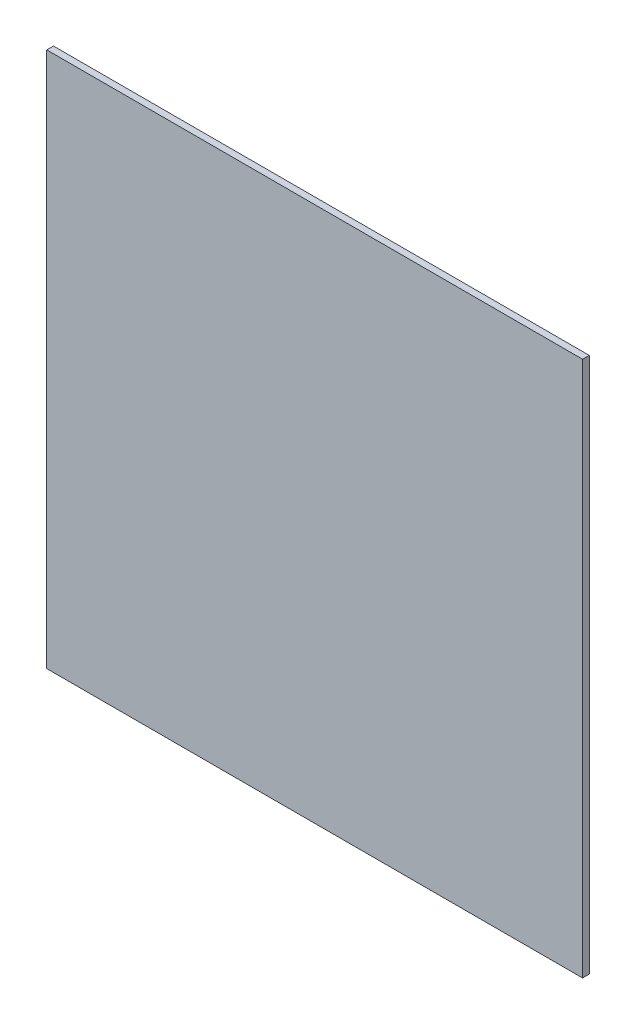
ISO-10303-21;
HEADER;
FILE_DESCRIPTION(('STEP AP214'),'2;1');
FILE_NAME('part.step','',(''),(''),'','','');
FILE_SCHEMA(('AUTOMOTIVE_DESIGN { 1 0 10303 214 1 1 1 1 }'));
ENDSEC;
DATA;
#1=APPLICATION_CONTEXT('core data for automotive mechanical design processes');
#2=APPLICATION_PROTOCOL_DEFINITION('international standard','automotive_design',2000,#1);
#3=PRODUCT_CONTEXT('',#1,'mechanical');
#4=PRODUCT('Part','Part','',(#3));
#5=PRODUCT_RELATED_PRODUCT_CATEGORY('part','',(#4));
#6=PRODUCT_DEFINITION_FORMATION('','',#4);
#7=PRODUCT_DEFINITION_CONTEXT('part definition',#1,'design');
#8=PRODUCT_DEFINITION('design','',#6,#7);
#9=PRODUCT_DEFINITION_SHAPE('','',#8);
#10=(LENGTH_UNIT() NAMED_UNIT(*) SI_UNIT(.MILLI.,.METRE.));
#11=(NAMED_UNIT(*) PLANE_ANGLE_UNIT() SI_UNIT($,.RADIAN.));
#12=(NAMED_UNIT(*) SI_UNIT($,.STERADIAN.) SOLID_ANGLE_UNIT());
#13=UNCERTAINTY_MEASURE_WITH_UNIT(LENGTH_MEASURE(1.E-05),#10,'distance_accuracy_value','');
#14=(GEOMETRIC_REPRESENTATION_CONTEXT(3) GLOBAL_UNCERTAINTY_ASSIGNED_CONTEXT((#13)) GLOBAL_UNIT_ASSIGNED_CONTEXT((#10,
#11,#12)) REPRESENTATION_CONTEXT('',''));
#15=CARTESIAN_POINT('',(0.,0.,0.));
#16=DIRECTION('',(0.,0.,1.));
#17=DIRECTION('',(1.,0.,0.));
#18=AXIS2_PLACEMENT_3D('',#15,#16,#17);
#19=CARTESIAN_POINT('',(0.,0.,2.54));
#20=DIRECTION('',(1.,0.,0.));
#21=DIRECTION('',(0.,0.,-1.));
#22=AXIS2_PLACEMENT_3D('',#19,#20,#21);
#23=PLANE('',#22);
#24=DIRECTION('',(0.,-1.,0.));
#25=VECTOR('',#24,1.);
#26=CARTESIAN_POINT('',(0.,0.,0.));
#27=LINE('',#26,#25);
#28=CARTESIAN_POINT('',(0.,203.2,0.));
#29=VERTEX_POINT('',#28);
#30=CARTESIAN_POINT('',(0.,0.,0.));
#31=VERTEX_POINT('',#30);
#32=EDGE_CURVE('E103',#29,#31,#27,.T.);
#33=ORIENTED_EDGE('',*,*,#32,.T.);
#34=DIRECTION('',(0.,0.,-1.));
#35=VECTOR('',#34,1.);
#36=CARTESIAN_POINT('',(0.,0.,2.54));
#37=LINE('',#36,#35);
#38=CARTESIAN_POINT('',(0.,0.,2.54));
#39=VERTEX_POINT('',#38);
#40=EDGE_CURVE('E11',#39,#31,#37,.T.);
#41=ORIENTED_EDGE('',*,*,#40,.F.);
#42=DIRECTION('',(0.,-1.,0.));
#43=VECTOR('',#42,1.);
#44=CARTESIAN_POINT('',(0.,0.,2.54));
#45=LINE('',#44,#43);
#46=CARTESIAN_POINT('',(0.,203.2,2.54));
#47=VERTEX_POINT('',#46);
#48=EDGE_CURVE('E91',#47,#39,#45,.T.);
#49=ORIENTED_EDGE('',*,*,#48,.F.);
#50=DIRECTION('',(0.,0.,-1.));
#51=VECTOR('',#50,1.);
#52=CARTESIAN_POINT('',(0.,203.2,2.54));
#53=LINE('',#52,#51);
#54=EDGE_CURVE('E99',#47,#29,#53,.T.);
#55=ORIENTED_EDGE('',*,*,#54,.T.);
#56=EDGE_LOOP('',(#33,#41,#49,#55));
#57=FACE_BOUND('',#56,.T.);
#58=ADVANCED_FACE('F40',(#57),#23,.F.);
#59=CARTESIAN_POINT('',(0.,0.,2.54));
#60=DIRECTION('',(0.,1.,0.));
#61=DIRECTION('',(0.,0.,1.));
#62=AXIS2_PLACEMENT_3D('',#59,#60,#61);
#63=PLANE('',#62);
#64=DIRECTION('',(1.,0.,0.));
#65=VECTOR('',#64,1.);
#66=CARTESIAN_POINT('',(0.,0.,0.));
#67=LINE('',#66,#65);
#68=CARTESIAN_POINT('',(203.2,0.,0.));
#69=VERTEX_POINT('',#68);
#70=EDGE_CURVE('E95',#31,#69,#67,.T.);
#71=ORIENTED_EDGE('',*,*,#70,.T.);
#72=DIRECTION('',(0.,0.,-1.));
#73=VECTOR('',#72,1.);
#74=CARTESIAN_POINT('',(203.2,0.,2.54));
#75=LINE('',#74,#73);
#76=CARTESIAN_POINT('',(203.2,0.,2.54));
#77=VERTEX_POINT('',#76);
#78=EDGE_CURVE('E48',#77,#69,#75,.T.);
#79=ORIENTED_EDGE('',*,*,#78,.F.);
#80=DIRECTION('',(1.,0.,0.));
#81=VECTOR('',#80,1.);
#82=CARTESIAN_POINT('',(0.,0.,2.54));
#83=LINE('',#82,#81);
#84=EDGE_CURVE('E86',#39,#77,#83,.T.);
#85=ORIENTED_EDGE('',*,*,#84,.F.);
#86=ORIENTED_EDGE('',*,*,#40,.T.);
#87=EDGE_LOOP('',(#71,#79,#85,#86));
#88=FACE_BOUND('',#87,.T.);
#89=ADVANCED_FACE('F94',(#88),#63,.F.);
#90=CARTESIAN_POINT('',(203.2,0.,2.54));
#91=DIRECTION('',(-1.,0.,0.));
#92=DIRECTION('',(0.,0.,1.));
#93=AXIS2_PLACEMENT_3D('',#90,#91,#92);
#94=PLANE('',#93);
#95=DIRECTION('',(0.,1.,0.));
#96=VECTOR('',#95,1.);
#97=CARTESIAN_POINT('',(203.2,0.,0.));
#98=LINE('',#97,#96);
#99=CARTESIAN_POINT('',(203.2,203.2,0.));
#100=VERTEX_POINT('',#99);
#101=EDGE_CURVE('E73',#69,#100,#98,.T.);
#102=ORIENTED_EDGE('',*,*,#101,.T.);
#103=DIRECTION('',(0.,0.,-1.));
#104=VECTOR('',#103,1.);
#105=CARTESIAN_POINT('',(203.2,203.2,2.54));
#106=LINE('',#105,#104);
#107=CARTESIAN_POINT('',(203.2,203.2,2.54));
#108=VERTEX_POINT('',#107);
#109=EDGE_CURVE('E96',#108,#100,#106,.T.);
#110=ORIENTED_EDGE('',*,*,#109,.F.);
#111=DIRECTION('',(0.,1.,0.));
#112=VECTOR('',#111,1.);
#113=CARTESIAN_POINT('',(203.2,0.,2.54));
#114=LINE('',#113,#112);
#115=EDGE_CURVE('E89',#77,#108,#114,.T.);
#116=ORIENTED_EDGE('',*,*,#115,.F.);
#117=ORIENTED_EDGE('',*,*,#78,.T.);
#118=EDGE_LOOP('',(#102,#110,#116,#117));
#119=FACE_BOUND('',#118,.T.);
#120=ADVANCED_FACE('F97',(#119),#94,.F.);
#121=CARTESIAN_POINT('',(0.,203.2,2.54));
#122=DIRECTION('',(0.,-1.,0.));
#123=DIRECTION('',(0.,0.,-1.));
#124=AXIS2_PLACEMENT_3D('',#121,#122,#123);
#125=PLANE('',#124);
#126=DIRECTION('',(-1.,0.,0.));
#127=VECTOR('',#126,1.);
#128=CARTESIAN_POINT('',(0.,203.2,0.));
#129=LINE('',#128,#127);
#130=EDGE_CURVE('E79',#100,#29,#129,.T.);
#131=ORIENTED_EDGE('',*,*,#130,.T.);
#132=ORIENTED_EDGE('',*,*,#54,.F.);
#133=DIRECTION('',(-1.,0.,0.));
#134=VECTOR('',#133,1.);
#135=CARTESIAN_POINT('',(0.,203.2,2.54));
#136=LINE('',#135,#134);
#137=EDGE_CURVE('E56',#108,#47,#136,.T.);
#138=ORIENTED_EDGE('',*,*,#137,.F.);
#139=ORIENTED_EDGE('',*,*,#109,.T.);
#140=EDGE_LOOP('',(#131,#132,#138,#139));
#141=FACE_BOUND('',#140,.T.);
#142=ADVANCED_FACE('F110',(#141),#125,.F.);
#143=CARTESIAN_POINT('',(0.,0.,2.54));
#144=DIRECTION('',(0.,0.,-1.));
#145=DIRECTION('',(-1.,0.,0.));
#146=AXIS2_PLACEMENT_3D('',#143,#144,#145);
#147=PLANE('',#146);
#148=ORIENTED_EDGE('',*,*,#48,.T.);
#149=ORIENTED_EDGE('',*,*,#84,.T.);
#150=ORIENTED_EDGE('',*,*,#115,.T.);
#151=ORIENTED_EDGE('',*,*,#137,.T.);
#152=EDGE_LOOP('',(#148,#149,#150,#151));
#153=FACE_BOUND('',#152,.T.);
#154=ADVANCED_FACE('F87',(#153),#147,.F.);
#155=CARTESIAN_POINT('',(0.,0.,0.));
#156=DIRECTION('',(0.,0.,-1.));
#157=DIRECTION('',(-1.,0.,0.));
#158=AXIS2_PLACEMENT_3D('',#155,#156,#157);
#159=PLANE('',#158);
#160=ORIENTED_EDGE('',*,*,#32,.F.);
#161=ORIENTED_EDGE('',*,*,#130,.F.);
#162=ORIENTED_EDGE('',*,*,#101,.F.);
#163=ORIENTED_EDGE('',*,*,#70,.F.);
#164=EDGE_LOOP('',(#160,#161,#162,#163));
#165=FACE_BOUND('',#164,.T.);
#166=ADVANCED_FACE('F113',(#165),#159,.T.);
#167=CLOSED_SHELL('',(#58,#89,#120,#142,#154,#166));
#168=MANIFOLD_SOLID_BREP('B2',#167);
#169=ADVANCED_BREP_SHAPE_REPRESENTATION('',(#18,#168),#14);
#170=SHAPE_DEFINITION_REPRESENTATION(#9,#169);
ENDSEC;
END-ISO-10303-21;
